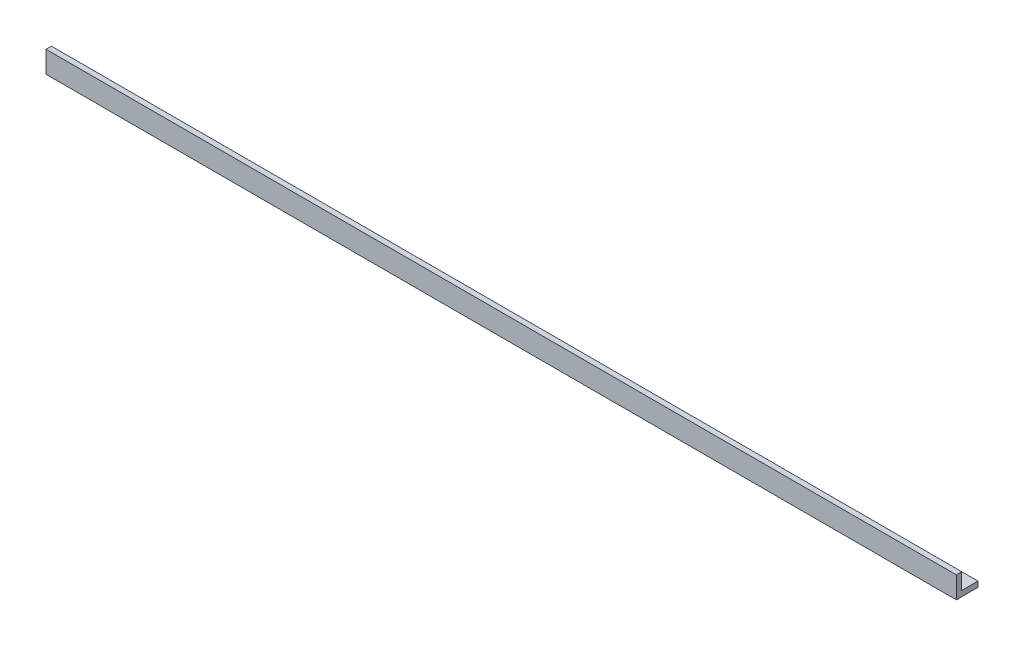
ISO-10303-21;
HEADER;
FILE_DESCRIPTION(('STEP AP214'),'2;1');
FILE_NAME('part.step','',(''),(''),'','','');
FILE_SCHEMA(('AUTOMOTIVE_DESIGN { 1 0 10303 214 1 1 1 1 }'));
ENDSEC;
DATA;
#1=APPLICATION_CONTEXT('core data for automotive mechanical design processes');
#2=APPLICATION_PROTOCOL_DEFINITION('international standard','automotive_design',2000,#1);
#3=PRODUCT_CONTEXT('',#1,'mechanical');
#4=PRODUCT('Part','Part','',(#3));
#5=PRODUCT_RELATED_PRODUCT_CATEGORY('part','',(#4));
#6=PRODUCT_DEFINITION_FORMATION('','',#4);
#7=PRODUCT_DEFINITION_CONTEXT('part definition',#1,'design');
#8=PRODUCT_DEFINITION('design','',#6,#7);
#9=PRODUCT_DEFINITION_SHAPE('','',#8);
#10=(LENGTH_UNIT() NAMED_UNIT(*) SI_UNIT(.MILLI.,.METRE.));
#11=(NAMED_UNIT(*) PLANE_ANGLE_UNIT() SI_UNIT($,.RADIAN.));
#12=(NAMED_UNIT(*) SI_UNIT($,.STERADIAN.) SOLID_ANGLE_UNIT());
#13=UNCERTAINTY_MEASURE_WITH_UNIT(LENGTH_MEASURE(1.E-05),#10,'distance_accuracy_value','');
#14=(GEOMETRIC_REPRESENTATION_CONTEXT(3) GLOBAL_UNCERTAINTY_ASSIGNED_CONTEXT((#13)) GLOBAL_UNIT_ASSIGNED_CONTEXT((#10,
#11,#12)) REPRESENTATION_CONTEXT('',''));
#15=CARTESIAN_POINT('',(0.,0.,0.));
#16=DIRECTION('',(0.,0.,1.));
#17=DIRECTION('',(1.,0.,0.));
#18=AXIS2_PLACEMENT_3D('',#15,#16,#17);
#19=CARTESIAN_POINT('',(-533.4,0.,-25.4));
#20=DIRECTION('',(0.,0.,1.));
#21=DIRECTION('',(1.,0.,0.));
#22=AXIS2_PLACEMENT_3D('',#19,#20,#21);
#23=PLANE('',#22);
#24=DIRECTION('',(1.,0.,0.));
#25=VECTOR('',#24,1.);
#26=CARTESIAN_POINT('',(-533.4,6.35,-25.4));
#27=LINE('',#26,#25);
#28=CARTESIAN_POINT('',(-533.4,6.35,-25.4));
#29=VERTEX_POINT('',#28);
#30=CARTESIAN_POINT('',(533.4,6.35,-25.4));
#31=VERTEX_POINT('',#30);
#32=EDGE_CURVE('E37',#29,#31,#27,.T.);
#33=ORIENTED_EDGE('',*,*,#32,.T.);
#34=DIRECTION('',(0.,-1.,0.));
#35=VECTOR('',#34,1.);
#36=CARTESIAN_POINT('',(533.4,0.,-25.4));
#37=LINE('',#36,#35);
#38=CARTESIAN_POINT('',(533.4,0.,-25.4));
#39=VERTEX_POINT('',#38);
#40=EDGE_CURVE('E89',#31,#39,#37,.T.);
#41=ORIENTED_EDGE('',*,*,#40,.T.);
#42=DIRECTION('',(1.,0.,0.));
#43=VECTOR('',#42,1.);
#44=CARTESIAN_POINT('',(-533.4,0.,-25.4));
#45=LINE('',#44,#43);
#46=CARTESIAN_POINT('',(-533.4,0.,-25.4));
#47=VERTEX_POINT('',#46);
#48=EDGE_CURVE('E11',#47,#39,#45,.T.);
#49=ORIENTED_EDGE('',*,*,#48,.F.);
#50=DIRECTION('',(0.,-1.,0.));
#51=VECTOR('',#50,1.);
#52=CARTESIAN_POINT('',(-533.4,0.,-25.4));
#53=LINE('',#52,#51);
#54=EDGE_CURVE('E50',#29,#47,#53,.T.);
#55=ORIENTED_EDGE('',*,*,#54,.F.);
#56=EDGE_LOOP('',(#33,#41,#49,#55));
#57=FACE_BOUND('',#56,.T.);
#58=ADVANCED_FACE('F34',(#57),#23,.F.);
#59=CARTESIAN_POINT('',(-533.4,0.,0.));
#60=DIRECTION('',(0.,-1.,0.));
#61=DIRECTION('',(0.,0.,-1.));
#62=AXIS2_PLACEMENT_3D('',#59,#60,#61);
#63=PLANE('',#62);
#64=ORIENTED_EDGE('',*,*,#48,.T.);
#65=DIRECTION('',(0.,0.,-1.));
#66=VECTOR('',#65,1.);
#67=CARTESIAN_POINT('',(533.4,0.,0.));
#68=LINE('',#67,#66);
#69=CARTESIAN_POINT('',(533.4,0.,0.));
#70=VERTEX_POINT('',#69);
#71=EDGE_CURVE('E103',#70,#39,#68,.T.);
#72=ORIENTED_EDGE('',*,*,#71,.F.);
#73=DIRECTION('',(1.,0.,0.));
#74=VECTOR('',#73,1.);
#75=CARTESIAN_POINT('',(-533.4,0.,0.));
#76=LINE('',#75,#74);
#77=CARTESIAN_POINT('',(-533.4,0.,0.));
#78=VERTEX_POINT('',#77);
#79=EDGE_CURVE('E42',#78,#70,#76,.T.);
#80=ORIENTED_EDGE('',*,*,#79,.F.);
#81=DIRECTION('',(0.,0.,-1.));
#82=VECTOR('',#81,1.);
#83=CARTESIAN_POINT('',(-533.4,0.,0.));
#84=LINE('',#83,#82);
#85=EDGE_CURVE('E94',#78,#47,#84,.T.);
#86=ORIENTED_EDGE('',*,*,#85,.T.);
#87=EDGE_LOOP('',(#64,#72,#80,#86));
#88=FACE_BOUND('',#87,.T.);
#89=ADVANCED_FACE('F143',(#88),#63,.T.);
#90=CARTESIAN_POINT('',(-533.4,0.,0.));
#91=DIRECTION('',(0.,0.,1.));
#92=DIRECTION('',(1.,0.,0.));
#93=AXIS2_PLACEMENT_3D('',#90,#91,#92);
#94=PLANE('',#93);
#95=ORIENTED_EDGE('',*,*,#79,.T.);
#96=DIRECTION('',(0.,-1.,0.));
#97=VECTOR('',#96,1.);
#98=CARTESIAN_POINT('',(533.4,0.,0.));
#99=LINE('',#98,#97);
#100=CARTESIAN_POINT('',(533.4,25.4,0.));
#101=VERTEX_POINT('',#100);
#102=EDGE_CURVE('E114',#101,#70,#99,.T.);
#103=ORIENTED_EDGE('',*,*,#102,.F.);
#104=DIRECTION('',(1.,0.,0.));
#105=VECTOR('',#104,1.);
#106=CARTESIAN_POINT('',(-533.4,25.4,0.));
#107=LINE('',#106,#105);
#108=CARTESIAN_POINT('',(-533.4,25.4,0.));
#109=VERTEX_POINT('',#108);
#110=EDGE_CURVE('E128',#109,#101,#107,.T.);
#111=ORIENTED_EDGE('',*,*,#110,.F.);
#112=DIRECTION('',(0.,-1.,0.));
#113=VECTOR('',#112,1.);
#114=CARTESIAN_POINT('',(-533.4,0.,0.));
#115=LINE('',#114,#113);
#116=EDGE_CURVE('E124',#109,#78,#115,.T.);
#117=ORIENTED_EDGE('',*,*,#116,.T.);
#118=EDGE_LOOP('',(#95,#103,#111,#117));
#119=FACE_BOUND('',#118,.T.);
#120=ADVANCED_FACE('F142',(#119),#94,.T.);
#121=CARTESIAN_POINT('',(-533.4,25.4,0.));
#122=DIRECTION('',(0.,-1.,0.));
#123=DIRECTION('',(0.,0.,-1.));
#124=AXIS2_PLACEMENT_3D('',#121,#122,#123);
#125=PLANE('',#124);
#126=ORIENTED_EDGE('',*,*,#110,.T.);
#127=DIRECTION('',(0.,0.,-1.));
#128=VECTOR('',#127,1.);
#129=CARTESIAN_POINT('',(533.4,25.4,0.));
#130=LINE('',#129,#128);
#131=CARTESIAN_POINT('',(533.4,25.4,-6.35));
#132=VERTEX_POINT('',#131);
#133=EDGE_CURVE('E109',#101,#132,#130,.T.);
#134=ORIENTED_EDGE('',*,*,#133,.T.);
#135=DIRECTION('',(1.,0.,0.));
#136=VECTOR('',#135,1.);
#137=CARTESIAN_POINT('',(-533.4,25.4,-6.35));
#138=LINE('',#137,#136);
#139=CARTESIAN_POINT('',(-533.4,25.4,-6.35));
#140=VERTEX_POINT('',#139);
#141=EDGE_CURVE('E130',#140,#132,#138,.T.);
#142=ORIENTED_EDGE('',*,*,#141,.F.);
#143=DIRECTION('',(0.,0.,-1.));
#144=VECTOR('',#143,1.);
#145=CARTESIAN_POINT('',(-533.4,25.4,0.));
#146=LINE('',#145,#144);
#147=EDGE_CURVE('E122',#109,#140,#146,.T.);
#148=ORIENTED_EDGE('',*,*,#147,.F.);
#149=EDGE_LOOP('',(#126,#134,#142,#148));
#150=FACE_BOUND('',#149,.T.);
#151=ADVANCED_FACE('F138',(#150),#125,.F.);
#152=CARTESIAN_POINT('',(-533.4,0.,-6.35));
#153=DIRECTION('',(0.,0.,1.));
#154=DIRECTION('',(1.,0.,0.));
#155=AXIS2_PLACEMENT_3D('',#152,#153,#154);
#156=PLANE('',#155);
#157=ORIENTED_EDGE('',*,*,#141,.T.);
#158=DIRECTION('',(0.,-1.,0.));
#159=VECTOR('',#158,1.);
#160=CARTESIAN_POINT('',(533.4,0.,-6.35));
#161=LINE('',#160,#159);
#162=CARTESIAN_POINT('',(533.4,6.35,-6.35));
#163=VERTEX_POINT('',#162);
#164=EDGE_CURVE('E107',#132,#163,#161,.T.);
#165=ORIENTED_EDGE('',*,*,#164,.T.);
#166=DIRECTION('',(1.,0.,0.));
#167=VECTOR('',#166,1.);
#168=CARTESIAN_POINT('',(-533.4,6.35,-6.35));
#169=LINE('',#168,#167);
#170=CARTESIAN_POINT('',(-533.4,6.35,-6.35));
#171=VERTEX_POINT('',#170);
#172=EDGE_CURVE('E93',#171,#163,#169,.T.);
#173=ORIENTED_EDGE('',*,*,#172,.F.);
#174=DIRECTION('',(0.,-1.,0.));
#175=VECTOR('',#174,1.);
#176=CARTESIAN_POINT('',(-533.4,0.,-6.35));
#177=LINE('',#176,#175);
#178=EDGE_CURVE('E120',#140,#171,#177,.T.);
#179=ORIENTED_EDGE('',*,*,#178,.F.);
#180=EDGE_LOOP('',(#157,#165,#173,#179));
#181=FACE_BOUND('',#180,.T.);
#182=ADVANCED_FACE('F134',(#181),#156,.F.);
#183=CARTESIAN_POINT('',(-533.4,6.35,0.));
#184=DIRECTION('',(0.,-1.,0.));
#185=DIRECTION('',(0.,0.,-1.));
#186=AXIS2_PLACEMENT_3D('',#183,#184,#185);
#187=PLANE('',#186);
#188=ORIENTED_EDGE('',*,*,#172,.T.);
#189=DIRECTION('',(0.,0.,-1.));
#190=VECTOR('',#189,1.);
#191=CARTESIAN_POINT('',(533.4,6.35,0.));
#192=LINE('',#191,#190);
#193=EDGE_CURVE('E100',#163,#31,#192,.T.);
#194=ORIENTED_EDGE('',*,*,#193,.T.);
#195=ORIENTED_EDGE('',*,*,#32,.F.);
#196=DIRECTION('',(0.,0.,-1.));
#197=VECTOR('',#196,1.);
#198=CARTESIAN_POINT('',(-533.4,6.35,0.));
#199=LINE('',#198,#197);
#200=EDGE_CURVE('E118',#171,#29,#199,.T.);
#201=ORIENTED_EDGE('',*,*,#200,.F.);
#202=EDGE_LOOP('',(#188,#194,#195,#201));
#203=FACE_BOUND('',#202,.T.);
#204=ADVANCED_FACE('F105',(#203),#187,.F.);
#205=CARTESIAN_POINT('',(-533.4,0.,0.));
#206=DIRECTION('',(1.,0.,0.));
#207=DIRECTION('',(0.,0.,-1.));
#208=AXIS2_PLACEMENT_3D('',#205,#206,#207);
#209=PLANE('',#208);
#210=ORIENTED_EDGE('',*,*,#54,.T.);
#211=ORIENTED_EDGE('',*,*,#85,.F.);
#212=ORIENTED_EDGE('',*,*,#116,.F.);
#213=ORIENTED_EDGE('',*,*,#147,.T.);
#214=ORIENTED_EDGE('',*,*,#178,.T.);
#215=ORIENTED_EDGE('',*,*,#200,.T.);
#216=EDGE_LOOP('',(#210,#211,#212,#213,#214,#215));
#217=FACE_BOUND('',#216,.T.);
#218=ADVANCED_FACE('F144',(#217),#209,.F.);
#219=CARTESIAN_POINT('',(533.4,0.,0.));
#220=DIRECTION('',(1.,0.,0.));
#221=DIRECTION('',(0.,0.,-1.));
#222=AXIS2_PLACEMENT_3D('',#219,#220,#221);
#223=PLANE('',#222);
#224=ORIENTED_EDGE('',*,*,#40,.F.);
#225=ORIENTED_EDGE('',*,*,#193,.F.);
#226=ORIENTED_EDGE('',*,*,#164,.F.);
#227=ORIENTED_EDGE('',*,*,#133,.F.);
#228=ORIENTED_EDGE('',*,*,#102,.T.);
#229=ORIENTED_EDGE('',*,*,#71,.T.);
#230=EDGE_LOOP('',(#224,#225,#226,#227,#228,#229));
#231=FACE_BOUND('',#230,.T.);
#232=ADVANCED_FACE('F98',(#231),#223,.T.);
#233=CLOSED_SHELL('',(#58,#89,#120,#151,#182,#204,#218,#232));
#234=MANIFOLD_SOLID_BREP('B2',#233);
#235=ADVANCED_BREP_SHAPE_REPRESENTATION('',(#18,#234),#14);
#236=SHAPE_DEFINITION_REPRESENTATION(#9,#235);
ENDSEC;
END-ISO-10303-21;
